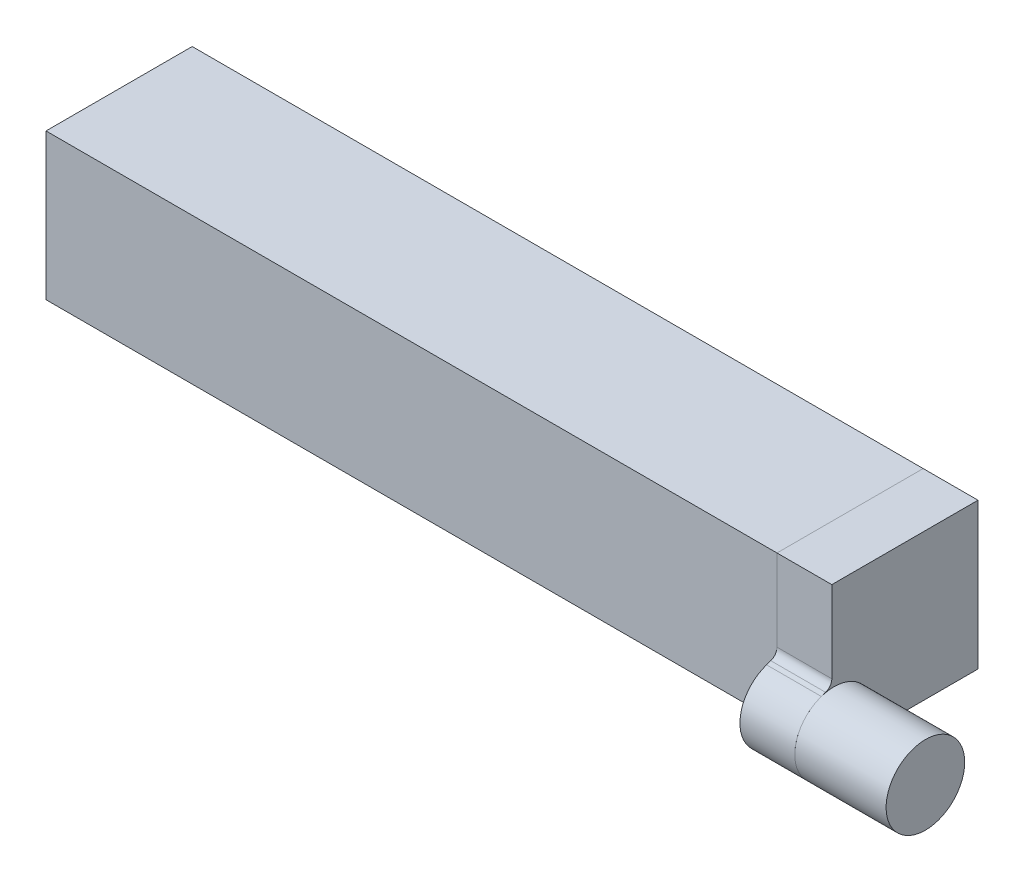
ISO-10303-21;
HEADER;
FILE_DESCRIPTION(('STEP AP214'),'2;1');
FILE_NAME('part.step','',(''),(''),'','','');
FILE_SCHEMA(('AUTOMOTIVE_DESIGN { 1 0 10303 214 1 1 1 1 }'));
ENDSEC;
DATA;
#1=APPLICATION_CONTEXT('core data for automotive mechanical design processes');
#2=APPLICATION_PROTOCOL_DEFINITION('international standard','automotive_design',2000,#1);
#3=PRODUCT_CONTEXT('',#1,'mechanical');
#4=PRODUCT('Part','Part','',(#3));
#5=PRODUCT_RELATED_PRODUCT_CATEGORY('part','',(#4));
#6=PRODUCT_DEFINITION_FORMATION('','',#4);
#7=PRODUCT_DEFINITION_CONTEXT('part definition',#1,'design');
#8=PRODUCT_DEFINITION('design','',#6,#7);
#9=PRODUCT_DEFINITION_SHAPE('','',#8);
#10=(LENGTH_UNIT() NAMED_UNIT(*) SI_UNIT(.MILLI.,.METRE.));
#11=(NAMED_UNIT(*) PLANE_ANGLE_UNIT() SI_UNIT($,.RADIAN.));
#12=(NAMED_UNIT(*) SI_UNIT($,.STERADIAN.) SOLID_ANGLE_UNIT());
#13=UNCERTAINTY_MEASURE_WITH_UNIT(LENGTH_MEASURE(1.E-05),#10,'distance_accuracy_value','');
#14=(GEOMETRIC_REPRESENTATION_CONTEXT(3) GLOBAL_UNCERTAINTY_ASSIGNED_CONTEXT((#13)) GLOBAL_UNIT_ASSIGNED_CONTEXT((#10,
#11,#12)) REPRESENTATION_CONTEXT('',''));
#15=CARTESIAN_POINT('',(0.,0.,0.));
#16=DIRECTION('',(0.,0.,1.));
#17=DIRECTION('',(1.,0.,0.));
#18=AXIS2_PLACEMENT_3D('',#15,#16,#17);
#19=CARTESIAN_POINT('',(48.,-3.0507296603373,3.87752792141577));
#20=DIRECTION('',(-1.,0.,0.));
#21=DIRECTION('',(0.,0.,1.));
#22=AXIS2_PLACEMENT_3D('',#19,#20,#21);
#23=CYLINDRICAL_SURFACE('',#22,2.15);
#24=CARTESIAN_POINT('',(48.,-3.0507296603373,3.87752792141577));
#25=DIRECTION('',(1.,0.,0.));
#26=DIRECTION('',(0.,0.,-1.));
#27=AXIS2_PLACEMENT_3D('',#24,#25,#26);
#28=CIRCLE('',#27,2.15);
#29=CARTESIAN_POINT('',(48.,-3.0507296603373,1.72752792141577));
#30=VERTEX_POINT('',#29);
#31=EDGE_CURVE('E11',#30,#30,#28,.T.);
#32=ORIENTED_EDGE('',*,*,#31,.F.);
#33=EDGE_LOOP('',(#32));
#34=FACE_BOUND('',#33,.T.);
#35=CARTESIAN_POINT('',(43.,-3.0507296603373,3.87752792141577));
#36=DIRECTION('',(1.,0.,0.));
#37=DIRECTION('',(0.,0.,-1.));
#38=AXIS2_PLACEMENT_3D('',#35,#36,#37);
#39=CIRCLE('',#38,2.15);
#40=CARTESIAN_POINT('',(43.,-3.0507296603373,1.72752792141577));
#41=VERTEX_POINT('',#40);
#42=EDGE_CURVE('E53',#41,#41,#39,.T.);
#43=ORIENTED_EDGE('',*,*,#42,.T.);
#44=EDGE_LOOP('',(#43));
#45=FACE_BOUND('',#44,.T.);
#46=ADVANCED_FACE('F50',(#34,#45),#23,.T.);
#47=CARTESIAN_POINT('',(48.,-3.0507296603373,3.87752792141577));
#48=DIRECTION('',(1.,0.,0.));
#49=DIRECTION('',(0.,0.,-1.));
#50=AXIS2_PLACEMENT_3D('',#47,#48,#49);
#51=PLANE('',#50);
#52=ORIENTED_EDGE('',*,*,#31,.T.);
#53=EDGE_LOOP('',(#52));
#54=FACE_BOUND('',#53,.T.);
#55=ADVANCED_FACE('F65',(#54),#51,.T.);
#56=CARTESIAN_POINT('',(43.,-3.0507296603373,3.87752792141577));
#57=DIRECTION('',(1.,0.,0.));
#58=DIRECTION('',(0.,0.,-1.));
#59=AXIS2_PLACEMENT_3D('',#56,#57,#58);
#60=PLANE('',#59);
#61=ORIENTED_EDGE('',*,*,#42,.F.);
#62=EDGE_LOOP('',(#61));
#63=FACE_BOUND('',#62,.T.);
#64=ADVANCED_FACE('F63',(#63),#60,.F.);
#65=CLOSED_SHELL('',(#46,#55,#64));
#66=MANIFOLD_SOLID_BREP('B2',#65);
#67=CARTESIAN_POINT('',(43.,-3.0507296603373,3.87752792141577));
#68=DIRECTION('',(-1.,0.,0.));
#69=DIRECTION('',(0.,0.,1.));
#70=AXIS2_PLACEMENT_3D('',#67,#68,#69);
#71=CYLINDRICAL_SURFACE('',#70,2.15);
#72=CARTESIAN_POINT('',(40.,-3.0507296603373,3.87752792141577));
#73=DIRECTION('',(1.,0.,0.));
#74=DIRECTION('',(0.,0.,-1.));
#75=AXIS2_PLACEMENT_3D('',#72,#73,#74);
#76=CIRCLE('',#75,2.15);
#77=CARTESIAN_POINT('',(40.,-1.01580057634583,4.5714757747345));
#78=VERTEX_POINT('',#77);
#79=CARTESIAN_POINT('',(40.,-5.08565874432876,3.18358006809704));
#80=VERTEX_POINT('',#79);
#81=EDGE_CURVE('E188',#78,#80,#76,.T.);
#82=ORIENTED_EDGE('',*,*,#81,.T.);
#83=DIRECTION('',(-1.,0.,0.));
#84=VECTOR('',#83,1.);
#85=CARTESIAN_POINT('',(43.,-5.08565874432876,3.18358006809704));
#86=LINE('',#85,#84);
#87=CARTESIAN_POINT('',(43.,-5.08565874432876,3.18358006809704));
#88=VERTEX_POINT('',#87);
#89=EDGE_CURVE('E169',#88,#80,#86,.T.);
#90=ORIENTED_EDGE('',*,*,#89,.F.);
#91=CARTESIAN_POINT('',(43.,-3.0507296603373,3.87752792141577));
#92=DIRECTION('',(1.,0.,0.));
#93=DIRECTION('',(0.,0.,-1.));
#94=AXIS2_PLACEMENT_3D('',#91,#92,#93);
#95=CIRCLE('',#94,2.15);
#96=CARTESIAN_POINT('',(43.,-1.01580057634583,4.5714757747345));
#97=VERTEX_POINT('',#96);
#98=EDGE_CURVE('E176',#97,#88,#95,.T.);
#99=ORIENTED_EDGE('',*,*,#98,.F.);
#100=DIRECTION('',(-1.,0.,0.));
#101=VECTOR('',#100,1.);
#102=CARTESIAN_POINT('',(43.,-1.01580057634583,4.5714757747345));
#103=LINE('',#102,#101);
#104=EDGE_CURVE('E205',#97,#78,#103,.T.);
#105=ORIENTED_EDGE('',*,*,#104,.T.);
#106=EDGE_LOOP('',(#82,#90,#99,#105));
#107=FACE_BOUND('',#106,.T.);
#108=ADVANCED_FACE('F100',(#107),#71,.T.);
#109=CARTESIAN_POINT('',(43.,-4.,0.));
#110=DIRECTION('',(0.,0.946478643716959,0.32276644340406));
#111=DIRECTION('',(0.,-0.32276644340406,0.946478643716959));
#112=AXIS2_PLACEMENT_3D('',#109,#110,#111);
#113=PLANE('',#112);
#114=DIRECTION('',(0.,0.32276644340406,-0.946478643716959));
#115=VECTOR('',#114,1.);
#116=CARTESIAN_POINT('',(40.,-4.,0.));
#117=LINE('',#116,#115);
#118=CARTESIAN_POINT('',(40.,-4.,0.));
#119=VERTEX_POINT('',#118);
#120=EDGE_CURVE('E216',#80,#119,#117,.T.);
#121=ORIENTED_EDGE('',*,*,#120,.T.);
#122=DIRECTION('',(-1.,0.,0.));
#123=VECTOR('',#122,1.);
#124=CARTESIAN_POINT('',(43.,-4.,0.));
#125=LINE('',#124,#123);
#126=CARTESIAN_POINT('',(43.,-4.,0.));
#127=VERTEX_POINT('',#126);
#128=EDGE_CURVE('E172',#127,#119,#125,.T.);
#129=ORIENTED_EDGE('',*,*,#128,.F.);
#130=DIRECTION('',(0.,0.32276644340406,-0.946478643716959));
#131=VECTOR('',#130,1.);
#132=CARTESIAN_POINT('',(43.,-4.,0.));
#133=LINE('',#132,#131);
#134=EDGE_CURVE('E165',#88,#127,#133,.T.);
#135=ORIENTED_EDGE('',*,*,#134,.F.);
#136=ORIENTED_EDGE('',*,*,#89,.T.);
#137=EDGE_LOOP('',(#121,#129,#135,#136));
#138=FACE_BOUND('',#137,.T.);
#139=ADVANCED_FACE('F167',(#138),#113,.F.);
#140=CARTESIAN_POINT('',(43.,-4.,-4.));
#141=DIRECTION('',(0.,1.,0.));
#142=DIRECTION('',(0.,0.,1.));
#143=AXIS2_PLACEMENT_3D('',#140,#141,#142);
#144=PLANE('',#143);
#145=DIRECTION('',(0.,0.,-1.));
#146=VECTOR('',#145,1.);
#147=CARTESIAN_POINT('',(40.,-4.,-4.));
#148=LINE('',#147,#146);
#149=CARTESIAN_POINT('',(40.,-4.,-4.));
#150=VERTEX_POINT('',#149);
#151=EDGE_CURVE('E214',#119,#150,#148,.T.);
#152=ORIENTED_EDGE('',*,*,#151,.T.);
#153=DIRECTION('',(-1.,0.,0.));
#154=VECTOR('',#153,1.);
#155=CARTESIAN_POINT('',(43.,-4.,-4.));
#156=LINE('',#155,#154);
#157=CARTESIAN_POINT('',(43.,-4.,-4.));
#158=VERTEX_POINT('',#157);
#159=EDGE_CURVE('E193',#158,#150,#156,.T.);
#160=ORIENTED_EDGE('',*,*,#159,.F.);
#161=DIRECTION('',(0.,0.,-1.));
#162=VECTOR('',#161,1.);
#163=CARTESIAN_POINT('',(43.,-4.,-4.));
#164=LINE('',#163,#162);
#165=EDGE_CURVE('E175',#127,#158,#164,.T.);
#166=ORIENTED_EDGE('',*,*,#165,.F.);
#167=ORIENTED_EDGE('',*,*,#128,.T.);
#168=EDGE_LOOP('',(#152,#160,#166,#167));
#169=FACE_BOUND('',#168,.T.);
#170=ADVANCED_FACE('F230',(#169),#144,.F.);
#171=CARTESIAN_POINT('',(43.,4.,-4.));
#172=DIRECTION('',(0.,0.,1.));
#173=DIRECTION('',(1.,0.,0.));
#174=AXIS2_PLACEMENT_3D('',#171,#172,#173);
#175=PLANE('',#174);
#176=DIRECTION('',(0.,1.,0.));
#177=VECTOR('',#176,1.);
#178=CARTESIAN_POINT('',(40.,4.,-4.));
#179=LINE('',#178,#177);
#180=CARTESIAN_POINT('',(40.,4.,-4.));
#181=VERTEX_POINT('',#180);
#182=EDGE_CURVE('E212',#150,#181,#179,.T.);
#183=ORIENTED_EDGE('',*,*,#182,.T.);
#184=DIRECTION('',(-1.,0.,0.));
#185=VECTOR('',#184,1.);
#186=CARTESIAN_POINT('',(43.,4.,-4.));
#187=LINE('',#186,#185);
#188=CARTESIAN_POINT('',(43.,4.,-4.));
#189=VERTEX_POINT('',#188);
#190=EDGE_CURVE('E199',#189,#181,#187,.T.);
#191=ORIENTED_EDGE('',*,*,#190,.F.);
#192=DIRECTION('',(0.,1.,0.));
#193=VECTOR('',#192,1.);
#194=CARTESIAN_POINT('',(43.,4.,-4.));
#195=LINE('',#194,#193);
#196=EDGE_CURVE('E224',#158,#189,#195,.T.);
#197=ORIENTED_EDGE('',*,*,#196,.F.);
#198=ORIENTED_EDGE('',*,*,#159,.T.);
#199=EDGE_LOOP('',(#183,#191,#197,#198));
#200=FACE_BOUND('',#199,.T.);
#201=ADVANCED_FACE('F234',(#200),#175,.F.);
#202=CARTESIAN_POINT('',(43.,4.,4.));
#203=DIRECTION('',(0.,-1.,0.));
#204=DIRECTION('',(0.,0.,-1.));
#205=AXIS2_PLACEMENT_3D('',#202,#203,#204);
#206=PLANE('',#205);
#207=DIRECTION('',(0.,0.,1.));
#208=VECTOR('',#207,1.);
#209=CARTESIAN_POINT('',(40.,4.,4.));
#210=LINE('',#209,#208);
#211=CARTESIAN_POINT('',(40.,4.,4.));
#212=VERTEX_POINT('',#211);
#213=EDGE_CURVE('E210',#181,#212,#210,.T.);
#214=ORIENTED_EDGE('',*,*,#213,.T.);
#215=DIRECTION('',(-1.,0.,0.));
#216=VECTOR('',#215,1.);
#217=CARTESIAN_POINT('',(43.,4.,4.));
#218=LINE('',#217,#216);
#219=CARTESIAN_POINT('',(43.,4.,4.));
#220=VERTEX_POINT('',#219);
#221=EDGE_CURVE('E202',#220,#212,#218,.T.);
#222=ORIENTED_EDGE('',*,*,#221,.F.);
#223=DIRECTION('',(0.,0.,1.));
#224=VECTOR('',#223,1.);
#225=CARTESIAN_POINT('',(43.,4.,4.));
#226=LINE('',#225,#224);
#227=EDGE_CURVE('E222',#189,#220,#226,.T.);
#228=ORIENTED_EDGE('',*,*,#227,.F.);
#229=ORIENTED_EDGE('',*,*,#190,.T.);
#230=EDGE_LOOP('',(#214,#222,#228,#229));
#231=FACE_BOUND('',#230,.T.);
#232=ADVANCED_FACE('F239',(#231),#206,.F.);
#233=CARTESIAN_POINT('',(43.,-0.820916936311168,4.));
#234=DIRECTION('',(0.,0.,-1.));
#235=DIRECTION('',(-1.,0.,0.));
#236=AXIS2_PLACEMENT_3D('',#233,#234,#235);
#237=PLANE('',#236);
#238=DIRECTION('',(0.,-1.,0.));
#239=VECTOR('',#238,1.);
#240=CARTESIAN_POINT('',(40.,-0.820916936311168,4.));
#241=LINE('',#240,#239);
#242=CARTESIAN_POINT('',(40.,-0.463152098672387,4.));
#243=VERTEX_POINT('',#242);
#244=EDGE_CURVE('E208',#212,#243,#241,.T.);
#245=ORIENTED_EDGE('',*,*,#244,.T.);
#246=DIRECTION('',(-1.,0.,0.));
#247=VECTOR('',#246,1.);
#248=CARTESIAN_POINT('',(43.,-0.463152098672387,4.));
#249=LINE('',#248,#247);
#250=CARTESIAN_POINT('',(43.,-0.463152098672387,4.));
#251=VERTEX_POINT('',#250);
#252=EDGE_CURVE('E115',#243,#251,#249,.F.);
#253=ORIENTED_EDGE('',*,*,#252,.T.);
#254=DIRECTION('',(0.,-1.,0.));
#255=VECTOR('',#254,1.);
#256=CARTESIAN_POINT('',(43.,-0.820916936311168,4.));
#257=LINE('',#256,#255);
#258=EDGE_CURVE('E220',#220,#251,#257,.T.);
#259=ORIENTED_EDGE('',*,*,#258,.F.);
#260=ORIENTED_EDGE('',*,*,#221,.T.);
#261=EDGE_LOOP('',(#245,#253,#259,#260));
#262=FACE_BOUND('',#261,.T.);
#263=ADVANCED_FACE('F246',(#262),#237,.F.);
#264=CARTESIAN_POINT('',(43.,-1.01580057634583,4.5714757747345));
#265=DIRECTION('',(0.,-0.946478643716959,-0.322766443404058));
#266=DIRECTION('',(0.,0.322766443404058,-0.946478643716959));
#267=AXIS2_PLACEMENT_3D('',#264,#265,#266);
#268=PLANE('',#267);
#269=DIRECTION('',(0.,-0.322766443404058,0.946478643716959));
#270=VECTOR('',#269,1.);
#271=CARTESIAN_POINT('',(43.,-1.01580057634583,4.5714757747345));
#272=LINE('',#271,#270);
#273=CARTESIAN_POINT('',(43.,-0.936391420530867,4.33861677829797));
#274=VERTEX_POINT('',#273);
#275=EDGE_CURVE('E181',#274,#97,#272,.T.);
#276=ORIENTED_EDGE('',*,*,#275,.F.);
#277=DIRECTION('',(-1.,0.,0.));
#278=VECTOR('',#277,1.);
#279=CARTESIAN_POINT('',(40.,-0.936391420530867,4.33861677829797));
#280=LINE('',#279,#278);
#281=CARTESIAN_POINT('',(40.,-0.936391420530867,4.33861677829797));
#282=VERTEX_POINT('',#281);
#283=EDGE_CURVE('E189',#274,#282,#280,.T.);
#284=ORIENTED_EDGE('',*,*,#283,.T.);
#285=DIRECTION('',(0.,-0.322766443404058,0.946478643716959));
#286=VECTOR('',#285,1.);
#287=CARTESIAN_POINT('',(40.,-1.01580057634583,4.5714757747345));
#288=LINE('',#287,#286);
#289=EDGE_CURVE('E185',#282,#78,#288,.T.);
#290=ORIENTED_EDGE('',*,*,#289,.T.);
#291=ORIENTED_EDGE('',*,*,#104,.F.);
#292=EDGE_LOOP('',(#276,#284,#290,#291));
#293=FACE_BOUND('',#292,.T.);
#294=ADVANCED_FACE('F244',(#293),#268,.F.);
#295=CARTESIAN_POINT('',(43.,-3.0507296603373,3.87752792141577));
#296=DIRECTION('',(1.,0.,0.));
#297=DIRECTION('',(0.,0.,-1.));
#298=AXIS2_PLACEMENT_3D('',#295,#296,#297);
#299=PLANE('',#298);
#300=ORIENTED_EDGE('',*,*,#98,.T.);
#301=ORIENTED_EDGE('',*,*,#134,.T.);
#302=ORIENTED_EDGE('',*,*,#165,.T.);
#303=ORIENTED_EDGE('',*,*,#196,.T.);
#304=ORIENTED_EDGE('',*,*,#227,.T.);
#305=ORIENTED_EDGE('',*,*,#258,.T.);
#306=CARTESIAN_POINT('',(43.,-0.463152098672387,4.5));
#307=DIRECTION('',(1.,0.,0.));
#308=DIRECTION('',(0.,0.,-1.));
#309=AXIS2_PLACEMENT_3D('',#306,#307,#308);
#310=CIRCLE('',#309,0.5);
#311=EDGE_CURVE('E48',#251,#274,#310,.F.);
#312=ORIENTED_EDGE('',*,*,#311,.T.);
#313=ORIENTED_EDGE('',*,*,#275,.T.);
#314=EDGE_LOOP('',(#300,#301,#302,#303,#304,#305,#312,#313));
#315=FACE_BOUND('',#314,.T.);
#316=ADVANCED_FACE('F179',(#315),#299,.T.);
#317=CARTESIAN_POINT('',(40.,-3.0507296603373,3.87752792141577));
#318=DIRECTION('',(1.,0.,0.));
#319=DIRECTION('',(0.,0.,-1.));
#320=AXIS2_PLACEMENT_3D('',#317,#318,#319);
#321=PLANE('',#320);
#322=ORIENTED_EDGE('',*,*,#81,.F.);
#323=ORIENTED_EDGE('',*,*,#289,.F.);
#324=CARTESIAN_POINT('',(40.,-0.463152098672387,4.5));
#325=DIRECTION('',(1.,0.,0.));
#326=DIRECTION('',(0.,0.,-1.));
#327=AXIS2_PLACEMENT_3D('',#324,#325,#326);
#328=CIRCLE('',#327,0.5);
#329=EDGE_CURVE('E108',#282,#243,#328,.T.);
#330=ORIENTED_EDGE('',*,*,#329,.T.);
#331=ORIENTED_EDGE('',*,*,#244,.F.);
#332=ORIENTED_EDGE('',*,*,#213,.F.);
#333=ORIENTED_EDGE('',*,*,#182,.F.);
#334=ORIENTED_EDGE('',*,*,#151,.F.);
#335=ORIENTED_EDGE('',*,*,#120,.F.);
#336=EDGE_LOOP('',(#322,#323,#330,#331,#332,#333,#334,#335));
#337=FACE_BOUND('',#336,.T.);
#338=ADVANCED_FACE('F245',(#337),#321,.F.);
#339=CARTESIAN_POINT('',(43.,-0.463152098672387,4.5));
#340=DIRECTION('',(1.,0.,0.));
#341=DIRECTION('',(0.,0.,-1.));
#342=AXIS2_PLACEMENT_3D('',#339,#340,#341);
#343=CYLINDRICAL_SURFACE('',#342,0.5);
#344=ORIENTED_EDGE('',*,*,#311,.F.);
#345=ORIENTED_EDGE('',*,*,#252,.F.);
#346=ORIENTED_EDGE('',*,*,#329,.F.);
#347=ORIENTED_EDGE('',*,*,#283,.F.);
#348=EDGE_LOOP('',(#344,#345,#346,#347));
#349=FACE_BOUND('',#348,.T.);
#350=ADVANCED_FACE('F102',(#349),#343,.F.);
#351=CLOSED_SHELL('',(#108,#139,#170,#201,#232,#263,#294,#316,#338,#350));
#352=MANIFOLD_SOLID_BREP('B6',#351);
#353=CARTESIAN_POINT('',(0.,0.,0.));
#354=DIRECTION('',(1.,0.,0.));
#355=DIRECTION('',(0.,0.,-1.));
#356=AXIS2_PLACEMENT_3D('',#353,#354,#355);
#357=PLANE('',#356);
#358=DIRECTION('',(0.,-1.,0.));
#359=VECTOR('',#358,1.);
#360=CARTESIAN_POINT('',(0.,-2.4,2.9));
#361=LINE('',#360,#359);
#362=CARTESIAN_POINT('',(0.,2.9,2.9));
#363=VERTEX_POINT('',#362);
#364=CARTESIAN_POINT('',(0.,-2.9,2.9));
#365=VERTEX_POINT('',#364);
#366=EDGE_CURVE('E472',#363,#365,#361,.T.);
#367=ORIENTED_EDGE('',*,*,#366,.T.);
#368=DIRECTION('',(0.,0.,-1.));
#369=VECTOR('',#368,1.);
#370=CARTESIAN_POINT('',(0.,-2.9,-2.4));
#371=LINE('',#370,#369);
#372=CARTESIAN_POINT('',(0.,-2.9,-2.9));
#373=VERTEX_POINT('',#372);
#374=EDGE_CURVE('E476',#365,#373,#371,.T.);
#375=ORIENTED_EDGE('',*,*,#374,.T.);
#376=DIRECTION('',(0.,1.,0.));
#377=VECTOR('',#376,1.);
#378=CARTESIAN_POINT('',(0.,2.4,-2.9));
#379=LINE('',#378,#377);
#380=CARTESIAN_POINT('',(0.,2.9,-2.9));
#381=VERTEX_POINT('',#380);
#382=EDGE_CURVE('E474',#373,#381,#379,.T.);
#383=ORIENTED_EDGE('',*,*,#382,.T.);
#384=DIRECTION('',(0.,0.,1.));
#385=VECTOR('',#384,1.);
#386=CARTESIAN_POINT('',(0.,2.9,2.4));
#387=LINE('',#386,#385);
#388=EDGE_CURVE('E417',#381,#363,#387,.T.);
#389=ORIENTED_EDGE('',*,*,#388,.T.);
#390=EDGE_LOOP('',(#367,#375,#383,#389));
#391=FACE_BOUND('',#390,.T.);
#392=DIRECTION('',(0.,-1.,0.));
#393=VECTOR('',#392,1.);
#394=CARTESIAN_POINT('',(0.,-4.,4.));
#395=LINE('',#394,#393);
#396=CARTESIAN_POINT('',(0.,4.,4.));
#397=VERTEX_POINT('',#396);
#398=CARTESIAN_POINT('',(0.,-4.,4.));
#399=VERTEX_POINT('',#398);
#400=EDGE_CURVE('E414',#397,#399,#395,.T.);
#401=ORIENTED_EDGE('',*,*,#400,.F.);
#402=DIRECTION('',(0.,0.,1.));
#403=VECTOR('',#402,1.);
#404=CARTESIAN_POINT('',(0.,4.,-4.));
#405=LINE('',#404,#403);
#406=CARTESIAN_POINT('',(0.,4.,-4.));
#407=VERTEX_POINT('',#406);
#408=EDGE_CURVE('E463',#407,#397,#405,.T.);
#409=ORIENTED_EDGE('',*,*,#408,.F.);
#410=DIRECTION('',(0.,1.,0.));
#411=VECTOR('',#410,1.);
#412=CARTESIAN_POINT('',(0.,-4.,-4.));
#413=LINE('',#412,#411);
#414=CARTESIAN_POINT('',(0.,-4.,-4.));
#415=VERTEX_POINT('',#414);
#416=EDGE_CURVE('E461',#415,#407,#413,.T.);
#417=ORIENTED_EDGE('',*,*,#416,.F.);
#418=DIRECTION('',(0.,0.,-1.));
#419=VECTOR('',#418,1.);
#420=CARTESIAN_POINT('',(0.,-4.,-4.));
#421=LINE('',#420,#419);
#422=EDGE_CURVE('E459',#399,#415,#421,.T.);
#423=ORIENTED_EDGE('',*,*,#422,.F.);
#424=EDGE_LOOP('',(#401,#409,#417,#423));
#425=FACE_BOUND('',#424,.T.);
#426=ADVANCED_FACE('F328',(#391,#425),#357,.F.);
#427=CARTESIAN_POINT('',(10.,-4.,4.));
#428=DIRECTION('',(0.,0.,-1.));
#429=DIRECTION('',(-1.,0.,0.));
#430=AXIS2_PLACEMENT_3D('',#427,#428,#429);
#431=PLANE('',#430);
#432=ORIENTED_EDGE('',*,*,#400,.T.);
#433=DIRECTION('',(-1.,0.,0.));
#434=VECTOR('',#433,1.);
#435=CARTESIAN_POINT('',(10.,-4.,4.));
#436=LINE('',#435,#434);
#437=CARTESIAN_POINT('',(40.,-4.,4.));
#438=VERTEX_POINT('',#437);
#439=EDGE_CURVE('E408',#438,#399,#436,.T.);
#440=ORIENTED_EDGE('',*,*,#439,.F.);
#441=DIRECTION('',(0.,1.,0.));
#442=VECTOR('',#441,1.);
#443=CARTESIAN_POINT('',(40.,0.,4.));
#444=LINE('',#443,#442);
#445=CARTESIAN_POINT('',(40.,4.,4.));
#446=VERTEX_POINT('',#445);
#447=EDGE_CURVE('E412',#438,#446,#444,.T.);
#448=ORIENTED_EDGE('',*,*,#447,.T.);
#449=DIRECTION('',(-1.,0.,0.));
#450=VECTOR('',#449,1.);
#451=CARTESIAN_POINT('',(10.,4.,4.));
#452=LINE('',#451,#450);
#453=EDGE_CURVE('E465',#446,#397,#452,.T.);
#454=ORIENTED_EDGE('',*,*,#453,.T.);
#455=EDGE_LOOP('',(#432,#440,#448,#454));
#456=FACE_BOUND('',#455,.T.);
#457=ADVANCED_FACE('F410',(#456),#431,.F.);
#458=CARTESIAN_POINT('',(10.,-4.,-4.));
#459=DIRECTION('',(0.,1.,0.));
#460=DIRECTION('',(0.,0.,1.));
#461=AXIS2_PLACEMENT_3D('',#458,#459,#460);
#462=PLANE('',#461);
#463=ORIENTED_EDGE('',*,*,#422,.T.);
#464=DIRECTION('',(-1.,0.,0.));
#465=VECTOR('',#464,1.);
#466=CARTESIAN_POINT('',(10.,-4.,-4.));
#467=LINE('',#466,#465);
#468=CARTESIAN_POINT('',(40.,-4.,-4.));
#469=VERTEX_POINT('',#468);
#470=EDGE_CURVE('E418',#469,#415,#467,.T.);
#471=ORIENTED_EDGE('',*,*,#470,.F.);
#472=DIRECTION('',(0.,0.,1.));
#473=VECTOR('',#472,1.);
#474=CARTESIAN_POINT('',(40.,-4.,0.));
#475=LINE('',#474,#473);
#476=EDGE_CURVE('E425',#469,#438,#475,.T.);
#477=ORIENTED_EDGE('',*,*,#476,.T.);
#478=ORIENTED_EDGE('',*,*,#439,.T.);
#479=EDGE_LOOP('',(#463,#471,#477,#478));
#480=FACE_BOUND('',#479,.T.);
#481=ADVANCED_FACE('F429',(#480),#462,.F.);
#482=CARTESIAN_POINT('',(10.,-4.,-4.));
#483=DIRECTION('',(0.,0.,1.));
#484=DIRECTION('',(1.,0.,0.));
#485=AXIS2_PLACEMENT_3D('',#482,#483,#484);
#486=PLANE('',#485);
#487=ORIENTED_EDGE('',*,*,#416,.T.);
#488=DIRECTION('',(-1.,0.,0.));
#489=VECTOR('',#488,1.);
#490=CARTESIAN_POINT('',(10.,4.,-4.));
#491=LINE('',#490,#489);
#492=CARTESIAN_POINT('',(40.,4.,-4.));
#493=VERTEX_POINT('',#492);
#494=EDGE_CURVE('E467',#493,#407,#491,.T.);
#495=ORIENTED_EDGE('',*,*,#494,.F.);
#496=DIRECTION('',(0.,1.,0.));
#497=VECTOR('',#496,1.);
#498=CARTESIAN_POINT('',(40.,0.,-4.));
#499=LINE('',#498,#497);
#500=EDGE_CURVE('E432',#469,#493,#499,.T.);
#501=ORIENTED_EDGE('',*,*,#500,.F.);
#502=ORIENTED_EDGE('',*,*,#470,.T.);
#503=EDGE_LOOP('',(#487,#495,#501,#502));
#504=FACE_BOUND('',#503,.T.);
#505=ADVANCED_FACE('F521',(#504),#486,.F.);
#506=CARTESIAN_POINT('',(10.,4.,-4.));
#507=DIRECTION('',(0.,-1.,0.));
#508=DIRECTION('',(0.,0.,-1.));
#509=AXIS2_PLACEMENT_3D('',#506,#507,#508);
#510=PLANE('',#509);
#511=ORIENTED_EDGE('',*,*,#408,.T.);
#512=ORIENTED_EDGE('',*,*,#453,.F.);
#513=DIRECTION('',(0.,0.,1.));
#514=VECTOR('',#513,1.);
#515=CARTESIAN_POINT('',(40.,4.,0.));
#516=LINE('',#515,#514);
#517=EDGE_CURVE('E427',#493,#446,#516,.T.);
#518=ORIENTED_EDGE('',*,*,#517,.F.);
#519=ORIENTED_EDGE('',*,*,#494,.T.);
#520=EDGE_LOOP('',(#511,#512,#518,#519));
#521=FACE_BOUND('',#520,.T.);
#522=ADVANCED_FACE('F523',(#521),#510,.F.);
#523=CARTESIAN_POINT('',(10.,-2.4,-2.4));
#524=DIRECTION('',(0.,0.,1.));
#525=DIRECTION('',(1.,0.,0.));
#526=AXIS2_PLACEMENT_3D('',#523,#524,#525);
#527=PLANE('',#526);
#528=DIRECTION('',(-1.,0.,0.));
#529=VECTOR('',#528,1.);
#530=CARTESIAN_POINT('',(10.,2.4,-2.4));
#531=LINE('',#530,#529);
#532=CARTESIAN_POINT('',(15.,2.4,-2.4));
#533=VERTEX_POINT('',#532);
#534=CARTESIAN_POINT('',(0.5,2.4,-2.4));
#535=VERTEX_POINT('',#534);
#536=EDGE_CURVE('E456',#533,#535,#531,.T.);
#537=ORIENTED_EDGE('',*,*,#536,.T.);
#538=DIRECTION('',(0.,1.,0.));
#539=VECTOR('',#538,1.);
#540=CARTESIAN_POINT('',(0.5,-2.4,-2.4));
#541=LINE('',#540,#539);
#542=CARTESIAN_POINT('',(0.5,-2.4,-2.4));
#543=VERTEX_POINT('',#542);
#544=EDGE_CURVE('E482',#535,#543,#541,.F.);
#545=ORIENTED_EDGE('',*,*,#544,.T.);
#546=DIRECTION('',(-1.,0.,0.));
#547=VECTOR('',#546,1.);
#548=CARTESIAN_POINT('',(10.,-2.4,-2.4));
#549=LINE('',#548,#547);
#550=CARTESIAN_POINT('',(15.,-2.4,-2.4));
#551=VERTEX_POINT('',#550);
#552=EDGE_CURVE('E449',#551,#543,#549,.T.);
#553=ORIENTED_EDGE('',*,*,#552,.F.);
#554=DIRECTION('',(0.,1.,0.));
#555=VECTOR('',#554,1.);
#556=CARTESIAN_POINT('',(15.,-2.4,-2.4));
#557=LINE('',#556,#555);
#558=EDGE_CURVE('E437',#551,#533,#557,.T.);
#559=ORIENTED_EDGE('',*,*,#558,.T.);
#560=EDGE_LOOP('',(#537,#545,#553,#559));
#561=FACE_BOUND('',#560,.T.);
#562=ADVANCED_FACE('F506',(#561),#527,.T.);
#563=CARTESIAN_POINT('',(10.,2.4,2.4));
#564=DIRECTION('',(0.,-1.,0.));
#565=DIRECTION('',(0.,0.,-1.));
#566=AXIS2_PLACEMENT_3D('',#563,#564,#565);
#567=PLANE('',#566);
#568=DIRECTION('',(-1.,0.,0.));
#569=VECTOR('',#568,1.);
#570=CARTESIAN_POINT('',(10.,2.4,2.4));
#571=LINE('',#570,#569);
#572=CARTESIAN_POINT('',(15.,2.4,2.4));
#573=VERTEX_POINT('',#572);
#574=CARTESIAN_POINT('',(0.5,2.4,2.4));
#575=VERTEX_POINT('',#574);
#576=EDGE_CURVE('E454',#573,#575,#571,.T.);
#577=ORIENTED_EDGE('',*,*,#576,.T.);
#578=DIRECTION('',(0.,0.,1.));
#579=VECTOR('',#578,1.);
#580=CARTESIAN_POINT('',(0.5,2.4,-2.4));
#581=LINE('',#580,#579);
#582=EDGE_CURVE('E98',#575,#535,#581,.F.);
#583=ORIENTED_EDGE('',*,*,#582,.T.);
#584=ORIENTED_EDGE('',*,*,#536,.F.);
#585=DIRECTION('',(0.,0.,1.));
#586=VECTOR('',#585,1.);
#587=CARTESIAN_POINT('',(15.,2.4,2.4));
#588=LINE('',#587,#586);
#589=EDGE_CURVE('E440',#533,#573,#588,.T.);
#590=ORIENTED_EDGE('',*,*,#589,.T.);
#591=EDGE_LOOP('',(#577,#583,#584,#590));
#592=FACE_BOUND('',#591,.T.);
#593=ADVANCED_FACE('F531',(#592),#567,.T.);
#594=CARTESIAN_POINT('',(10.,-2.4,2.4));
#595=DIRECTION('',(0.,0.,-1.));
#596=DIRECTION('',(-1.,0.,0.));
#597=AXIS2_PLACEMENT_3D('',#594,#595,#596);
#598=PLANE('',#597);
#599=DIRECTION('',(-1.,0.,0.));
#600=VECTOR('',#599,1.);
#601=CARTESIAN_POINT('',(10.,-2.4,2.4));
#602=LINE('',#601,#600);
#603=CARTESIAN_POINT('',(15.,-2.4,2.4));
#604=VERTEX_POINT('',#603);
#605=CARTESIAN_POINT('',(0.5,-2.4,2.4));
#606=VERTEX_POINT('',#605);
#607=EDGE_CURVE('E452',#604,#606,#602,.T.);
#608=ORIENTED_EDGE('',*,*,#607,.T.);
#609=DIRECTION('',(0.,-1.,0.));
#610=VECTOR('',#609,1.);
#611=CARTESIAN_POINT('',(0.5,2.4,2.4));
#612=LINE('',#611,#610);
#613=EDGE_CURVE('E337',#606,#575,#612,.F.);
#614=ORIENTED_EDGE('',*,*,#613,.T.);
#615=ORIENTED_EDGE('',*,*,#576,.F.);
#616=DIRECTION('',(0.,-1.,0.));
#617=VECTOR('',#616,1.);
#618=CARTESIAN_POINT('',(15.,-2.4,2.4));
#619=LINE('',#618,#617);
#620=EDGE_CURVE('E443',#573,#604,#619,.T.);
#621=ORIENTED_EDGE('',*,*,#620,.T.);
#622=EDGE_LOOP('',(#608,#614,#615,#621));
#623=FACE_BOUND('',#622,.T.);
#624=ADVANCED_FACE('F558',(#623),#598,.T.);
#625=CARTESIAN_POINT('',(10.,-2.4,2.4));
#626=DIRECTION('',(0.,1.,0.));
#627=DIRECTION('',(0.,0.,1.));
#628=AXIS2_PLACEMENT_3D('',#625,#626,#627);
#629=PLANE('',#628);
#630=ORIENTED_EDGE('',*,*,#552,.T.);
#631=DIRECTION('',(0.,0.,-1.));
#632=VECTOR('',#631,1.);
#633=CARTESIAN_POINT('',(0.5,-2.4,2.4));
#634=LINE('',#633,#632);
#635=EDGE_CURVE('E479',#543,#606,#634,.F.);
#636=ORIENTED_EDGE('',*,*,#635,.T.);
#637=ORIENTED_EDGE('',*,*,#607,.F.);
#638=DIRECTION('',(0.,0.,-1.));
#639=VECTOR('',#638,1.);
#640=CARTESIAN_POINT('',(15.,-2.4,2.4));
#641=LINE('',#640,#639);
#642=EDGE_CURVE('E446',#604,#551,#641,.T.);
#643=ORIENTED_EDGE('',*,*,#642,.T.);
#644=EDGE_LOOP('',(#630,#636,#637,#643));
#645=FACE_BOUND('',#644,.T.);
#646=ADVANCED_FACE('F509',(#645),#629,.T.);
#647=CARTESIAN_POINT('',(15.,0.,0.));
#648=DIRECTION('',(1.,0.,0.));
#649=DIRECTION('',(0.,0.,-1.));
#650=AXIS2_PLACEMENT_3D('',#647,#648,#649);
#651=PLANE('',#650);
#652=ORIENTED_EDGE('',*,*,#589,.F.);
#653=ORIENTED_EDGE('',*,*,#558,.F.);
#654=ORIENTED_EDGE('',*,*,#642,.F.);
#655=ORIENTED_EDGE('',*,*,#620,.F.);
#656=EDGE_LOOP('',(#652,#653,#654,#655));
#657=FACE_BOUND('',#656,.T.);
#658=ADVANCED_FACE('F550',(#657),#651,.F.);
#659=CARTESIAN_POINT('',(40.,0.,0.));
#660=DIRECTION('',(1.,0.,0.));
#661=DIRECTION('',(0.,0.,-1.));
#662=AXIS2_PLACEMENT_3D('',#659,#660,#661);
#663=PLANE('',#662);
#664=ORIENTED_EDGE('',*,*,#447,.F.);
#665=ORIENTED_EDGE('',*,*,#476,.F.);
#666=ORIENTED_EDGE('',*,*,#500,.T.);
#667=ORIENTED_EDGE('',*,*,#517,.T.);
#668=EDGE_LOOP('',(#664,#665,#666,#667));
#669=FACE_BOUND('',#668,.T.);
#670=ADVANCED_FACE('F423',(#669),#663,.T.);
#671=CARTESIAN_POINT('',(0.5,2.9,0.));
#672=DIRECTION('',(0.,0.,-1.));
#673=DIRECTION('',(-1.,0.,0.));
#674=AXIS2_PLACEMENT_3D('',#671,#672,#673);
#675=CYLINDRICAL_SURFACE('',#674,0.5);
#676=CARTESIAN_POINT('',(0.5,2.9,-2.9));
#677=DIRECTION('',(0.,-0.707106781186547,-0.707106781186547));
#678=DIRECTION('',(0.,-0.707106781186547,0.707106781186547));
#679=AXIS2_PLACEMENT_3D('',#676,#677,#678);
#680=ELLIPSE('',#679,0.707106781186547,0.5);
#681=EDGE_CURVE('E488',#535,#381,#680,.T.);
#682=ORIENTED_EDGE('',*,*,#681,.F.);
#683=ORIENTED_EDGE('',*,*,#582,.F.);
#684=CARTESIAN_POINT('',(0.5,2.9,2.9));
#685=DIRECTION('',(0.,0.707106781186547,-0.707106781186547));
#686=DIRECTION('',(0.,0.707106781186547,0.707106781186547));
#687=AXIS2_PLACEMENT_3D('',#684,#685,#686);
#688=ELLIPSE('',#687,0.707106781186547,0.5);
#689=EDGE_CURVE('E332',#363,#575,#688,.F.);
#690=ORIENTED_EDGE('',*,*,#689,.F.);
#691=ORIENTED_EDGE('',*,*,#388,.F.);
#692=EDGE_LOOP('',(#682,#683,#690,#691));
#693=FACE_BOUND('',#692,.T.);
#694=ADVANCED_FACE('F330',(#693),#675,.T.);
#695=CARTESIAN_POINT('',(0.5,0.,2.9));
#696=DIRECTION('',(0.,1.,0.));
#697=DIRECTION('',(0.,0.,1.));
#698=AXIS2_PLACEMENT_3D('',#695,#696,#697);
#699=CYLINDRICAL_SURFACE('',#698,0.5);
#700=ORIENTED_EDGE('',*,*,#689,.T.);
#701=ORIENTED_EDGE('',*,*,#613,.F.);
#702=CARTESIAN_POINT('',(0.5,-2.9,2.9));
#703=DIRECTION('',(0.,0.707106781186547,0.707106781186547));
#704=DIRECTION('',(0.,-0.707106781186547,0.707106781186547));
#705=AXIS2_PLACEMENT_3D('',#702,#703,#704);
#706=ELLIPSE('',#705,0.707106781186547,0.5);
#707=EDGE_CURVE('E487',#365,#606,#706,.F.);
#708=ORIENTED_EDGE('',*,*,#707,.F.);
#709=ORIENTED_EDGE('',*,*,#366,.F.);
#710=EDGE_LOOP('',(#700,#701,#708,#709));
#711=FACE_BOUND('',#710,.T.);
#712=ADVANCED_FACE('F498',(#711),#699,.T.);
#713=CARTESIAN_POINT('',(0.5,0.,-2.9));
#714=DIRECTION('',(0.,-1.,0.));
#715=DIRECTION('',(0.,0.,-1.));
#716=AXIS2_PLACEMENT_3D('',#713,#714,#715);
#717=CYLINDRICAL_SURFACE('',#716,0.5);
#718=ORIENTED_EDGE('',*,*,#681,.T.);
#719=ORIENTED_EDGE('',*,*,#382,.F.);
#720=CARTESIAN_POINT('',(0.5,-2.9,-2.9));
#721=DIRECTION('',(0.,-0.707106781186547,0.707106781186547));
#722=DIRECTION('',(0.,0.707106781186547,0.707106781186547));
#723=AXIS2_PLACEMENT_3D('',#720,#721,#722);
#724=ELLIPSE('',#723,0.707106781186547,0.5);
#725=EDGE_CURVE('E485',#543,#373,#724,.T.);
#726=ORIENTED_EDGE('',*,*,#725,.F.);
#727=ORIENTED_EDGE('',*,*,#544,.F.);
#728=EDGE_LOOP('',(#718,#719,#726,#727));
#729=FACE_BOUND('',#728,.T.);
#730=ADVANCED_FACE('F503',(#729),#717,.T.);
#731=CARTESIAN_POINT('',(0.5,-2.9,0.));
#732=DIRECTION('',(0.,0.,1.));
#733=DIRECTION('',(1.,0.,0.));
#734=AXIS2_PLACEMENT_3D('',#731,#732,#733);
#735=CYLINDRICAL_SURFACE('',#734,0.5);
#736=ORIENTED_EDGE('',*,*,#707,.T.);
#737=ORIENTED_EDGE('',*,*,#635,.F.);
#738=ORIENTED_EDGE('',*,*,#725,.T.);
#739=ORIENTED_EDGE('',*,*,#374,.F.);
#740=EDGE_LOOP('',(#736,#737,#738,#739));
#741=FACE_BOUND('',#740,.T.);
#742=ADVANCED_FACE('F512',(#741),#735,.T.);
#743=CLOSED_SHELL('',(#426,#457,#481,#505,#522,#562,#593,#624,#646,#658,#670,#694,#712,#730,#742));
#744=MANIFOLD_SOLID_BREP('B42',#743);
#745=ADVANCED_BREP_SHAPE_REPRESENTATION('',(#18,#66,#352,#744),#14);
#746=SHAPE_DEFINITION_REPRESENTATION(#9,#745);
ENDSEC;
END-ISO-10303-21;
